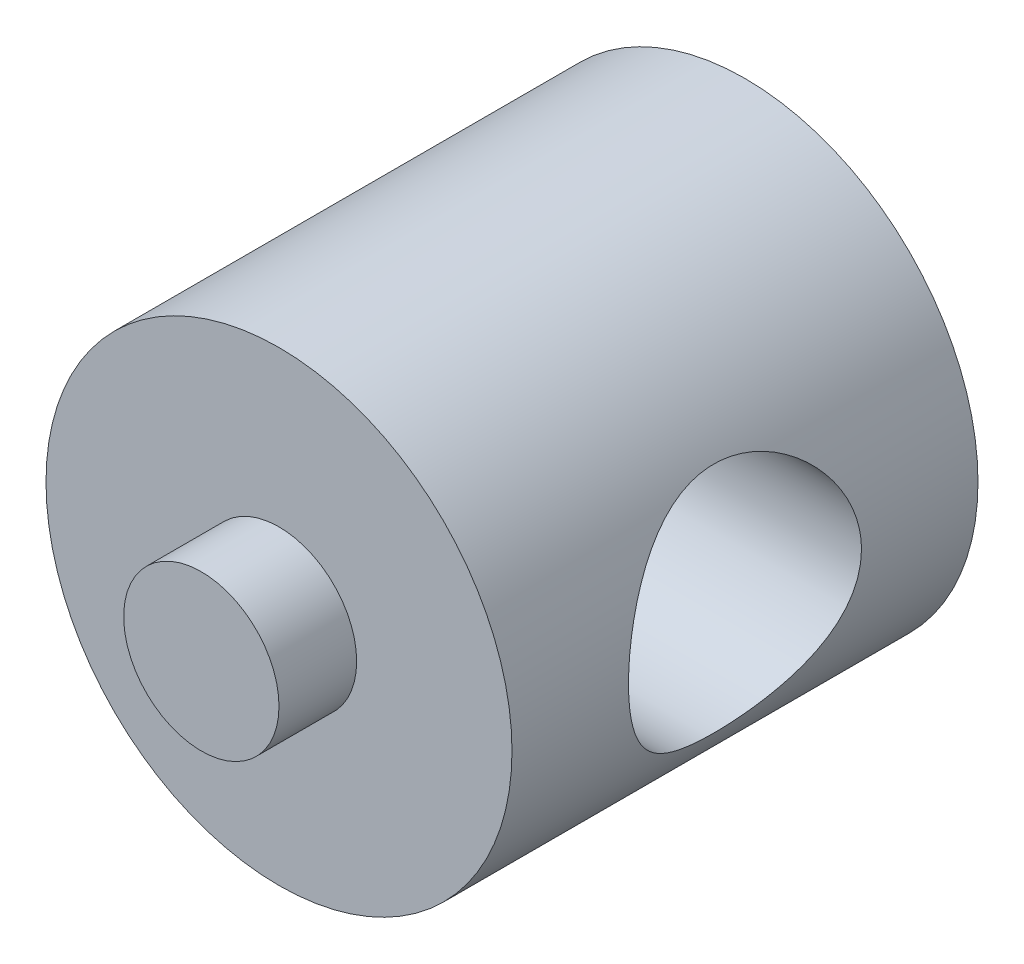
ISO-10303-21;
HEADER;
FILE_DESCRIPTION(('STEP AP214'),'2;1');
FILE_NAME('part.step','',(''),(''),'','','');
FILE_SCHEMA(('AUTOMOTIVE_DESIGN { 1 0 10303 214 1 1 1 1 }'));
ENDSEC;
DATA;
#1=APPLICATION_CONTEXT('core data for automotive mechanical design processes');
#2=APPLICATION_PROTOCOL_DEFINITION('international standard','automotive_design',2000,#1);
#3=PRODUCT_CONTEXT('',#1,'mechanical');
#4=PRODUCT('Part','Part','',(#3));
#5=PRODUCT_RELATED_PRODUCT_CATEGORY('part','',(#4));
#6=PRODUCT_DEFINITION_FORMATION('','',#4);
#7=PRODUCT_DEFINITION_CONTEXT('part definition',#1,'design');
#8=PRODUCT_DEFINITION('design','',#6,#7);
#9=PRODUCT_DEFINITION_SHAPE('','',#8);
#10=(LENGTH_UNIT() NAMED_UNIT(*) SI_UNIT(.MILLI.,.METRE.));
#11=(NAMED_UNIT(*) PLANE_ANGLE_UNIT() SI_UNIT($,.RADIAN.));
#12=(NAMED_UNIT(*) SI_UNIT($,.STERADIAN.) SOLID_ANGLE_UNIT());
#13=UNCERTAINTY_MEASURE_WITH_UNIT(LENGTH_MEASURE(1.E-05),#10,'distance_accuracy_value','');
#14=(GEOMETRIC_REPRESENTATION_CONTEXT(3) GLOBAL_UNCERTAINTY_ASSIGNED_CONTEXT((#13)) GLOBAL_UNIT_ASSIGNED_CONTEXT((#10,
#11,#12)) REPRESENTATION_CONTEXT('',''));
#15=CARTESIAN_POINT('',(0.,0.,0.));
#16=DIRECTION('',(0.,0.,1.));
#17=DIRECTION('',(1.,0.,0.));
#18=AXIS2_PLACEMENT_3D('',#15,#16,#17);
#19=CARTESIAN_POINT('',(0.,0.,9.525));
#20=DIRECTION('',(0.,0.,-1.));
#21=DIRECTION('',(-1.,0.,0.));
#22=AXIS2_PLACEMENT_3D('',#19,#20,#21);
#23=CYLINDRICAL_SURFACE('',#22,9.525);
#24=CARTESIAN_POINT('',(-9.525,0.,-4.7625));
#25=CARTESIAN_POINT('',(-9.5249996206372,0.125243167799989,-4.76249958831423));
#26=CARTESIAN_POINT('',(-9.52252400598023,0.250495089131835,-4.75755388154092));
#27=CARTESIAN_POINT('',(-9.51268396387997,0.500076393496525,-4.73782749335829));
#28=CARTESIAN_POINT('',(-9.50531740964971,0.624405351393145,-4.72304253341983));
#29=CARTESIAN_POINT('',(-9.48587193787975,0.871331001268147,-4.68378465754782));
#30=CARTESIAN_POINT('',(-9.47378630044847,0.993924963523297,-4.65929792572799));
#31=CARTESIAN_POINT('',(-9.44520637539277,1.23637011508467,-4.60090773438337));
#32=CARTESIAN_POINT('',(-9.42871028557932,1.35622016139572,-4.56700042522137));
#33=CARTESIAN_POINT('',(-9.39179697222459,1.59183120722171,-4.49029599546492));
#34=CARTESIAN_POINT('',(-9.37139708461428,1.70760770137533,-4.44753811225714));
#35=CARTESIAN_POINT('',(-9.3271126718355,1.93495086483045,-4.35345002008972));
#36=CARTESIAN_POINT('',(-9.30322683559748,2.04651593025,-4.30211658479887));
#37=CARTESIAN_POINT('',(-9.22716144615755,2.37384489745524,-4.13594585342937));
#38=CARTESIAN_POINT('',(-9.17053150857179,2.58250225923313,-4.00885268845467));
#39=CARTESIAN_POINT('',(-9.04666081910159,2.9885453858336,-3.7170309696508));
#40=CARTESIAN_POINT('',(-8.97898540114139,3.18448556312959,-3.55049071765087));
#41=CARTESIAN_POINT('',(-8.84205954293001,3.5469969745544,-3.18840889326789));
#42=CARTESIAN_POINT('',(-8.77280794740667,3.71354582861883,-2.99284542792684));
#43=CARTESIAN_POINT('',(-8.63435408613187,4.02553537328567,-2.5598674226152));
#44=CARTESIAN_POINT('',(-8.56557212539103,4.16833749963762,-2.32038345074362));
#45=CARTESIAN_POINT('',(-8.47379640254792,4.35029005345507,-1.94317806162735));
#46=CARTESIAN_POINT('',(-8.44509626519091,4.40557901885787,-1.81439982504697));
#47=CARTESIAN_POINT('',(-8.39256904955604,4.50483773649694,-1.55162131087768));
#48=CARTESIAN_POINT('',(-8.36873908777994,4.54881419057647,-1.4176241795386));
#49=CARTESIAN_POINT('',(-8.32818911059645,4.62261399582858,-1.15348439070287));
#50=CARTESIAN_POINT('',(-8.31113119648639,4.65312214328153,-1.0235845780924));
#51=CARTESIAN_POINT('',(-8.28290506375683,4.7031837839128,-0.76111831285817));
#52=CARTESIAN_POINT('',(-8.27173372047612,4.72274308921002,-0.62855331382261));
#53=CARTESIAN_POINT('',(-8.25575723957705,4.75061653464239,-0.36194274554475));
#54=CARTESIAN_POINT('',(-8.25094826797976,4.75893744712047,-0.227898117086417));
#55=CARTESIAN_POINT('',(-8.24790017307781,4.76421854927812,0.0404818193190367));
#56=CARTESIAN_POINT('',(-8.24966042295241,4.76117982286953,0.174817098310511));
#57=CARTESIAN_POINT('',(-8.25906842780931,4.74483797280581,0.426439463053397));
#58=CARTESIAN_POINT('',(-8.26598467895691,4.73280973448218,0.543838732731229));
#59=CARTESIAN_POINT('',(-8.28459407928507,4.7001560114978,0.777063325744908));
#60=CARTESIAN_POINT('',(-8.29628872876442,4.67952782662532,0.89288814292927));
#61=CARTESIAN_POINT('',(-8.33800444414718,4.60506661909892,1.23679640510272));
#62=CARTESIAN_POINT('',(-8.37466460391199,4.5386452957775,1.46148677858525));
#63=CARTESIAN_POINT('',(-8.46236620531704,4.37297035741612,1.90136422745735));
#64=CARTESIAN_POINT('',(-8.51372273880604,4.27298801966147,2.11620803502557));
#65=CARTESIAN_POINT('',(-8.62505005190895,4.04355977442936,2.52713750391294));
#66=CARTESIAN_POINT('',(-8.68502469635285,3.91410063264098,2.72321468317278));
#67=CARTESIAN_POINT('',(-8.8160120789406,3.61029947812718,3.11715493103464));
#68=CARTESIAN_POINT('',(-8.88746017331488,3.43234782914613,3.31209202014425));
#69=CARTESIAN_POINT('',(-9.02721381532401,3.04584295330871,3.67064878147008));
#70=CARTESIAN_POINT('',(-9.0955178493011,2.83727518509305,3.83425348656057));
#71=CARTESIAN_POINT('',(-9.19195370403877,2.49965137796343,4.05616532663717));
#72=CARTESIAN_POINT('',(-9.22372787983903,2.38002127368373,4.12751797031745));
#73=CARTESIAN_POINT('',(-9.28366556941997,2.13427687141611,4.25977821368204));
#74=CARTESIAN_POINT('',(-9.31183060399966,2.00816533613017,4.32069021646027));
#75=CARTESIAN_POINT('',(-9.36371844925579,1.75034069526616,4.43140995548221));
#76=CARTESIAN_POINT('',(-9.38744304755807,1.61862987016266,4.48122216181515));
#77=CARTESIAN_POINT('',(-9.42974072645533,1.35056106639509,4.56916623782169));
#78=CARTESIAN_POINT('',(-9.4483143996453,1.21420362433566,4.60729945117316));
#79=CARTESIAN_POINT('',(-9.47841891468132,0.949450109300047,4.66871072091767));
#80=CARTESIAN_POINT('',(-9.49040564136936,0.821329961906901,4.69295751387122));
#81=CARTESIAN_POINT('',(-9.50921741531494,0.563164063018347,4.73088465881512));
#82=CARTESIAN_POINT('',(-9.51604291885924,0.433118482780759,4.74456594486943));
#83=CARTESIAN_POINT('',(-9.52433687415141,0.172222200636558,4.76117903695803));
#84=CARTESIAN_POINT('',(-9.52580737679104,0.0413718261918288,4.76411495832146));
#85=CARTESIAN_POINT('',(-9.52335444060485,-0.220072847166308,4.75920856581017));
#86=CARTESIAN_POINT('',(-9.51943124049279,-0.350667157156418,4.75136672893597));
#87=CARTESIAN_POINT('',(-9.50681651861088,-0.600383632816324,4.72603956317407));
#88=CARTESIAN_POINT('',(-9.49851975936574,-0.71960779805965,4.70935204534436));
#89=CARTESIAN_POINT('',(-9.47763434053446,-0.956123558476324,4.66708381392194));
#90=CARTESIAN_POINT('',(-9.46504432155854,-1.07341452918894,4.64150028350313));
#91=CARTESIAN_POINT('',(-9.43586934009923,-1.30523272581462,4.58171294409776));
#92=CARTESIAN_POINT('',(-9.41928560017321,-1.41976078572846,4.54751177299423));
#93=CARTESIAN_POINT('',(-9.382499981618,-1.64542419391326,4.47081767633952));
#94=CARTESIAN_POINT('',(-9.36229671724176,-1.75655822362735,4.42832157448654));
#95=CARTESIAN_POINT('',(-9.29566539786795,-2.09007412634844,4.2862997139752));
#96=CARTESIAN_POINT('',(-9.24405921515466,-2.3061103310862,4.17391144344975));
#97=CARTESIAN_POINT('',(-9.13180205397676,-2.7168591855057,3.91901153595821));
#98=CARTESIAN_POINT('',(-9.07114722574502,-2.91156269769227,3.77648706665232));
#99=CARTESIAN_POINT('',(-8.93960783885979,-3.29452731372962,3.44920510528762));
#100=CARTESIAN_POINT('',(-8.868303631423,-3.48027815582499,3.26167471385581));
#101=CARTESIAN_POINT('',(-8.72786114875584,-3.81886460963264,2.85781381337991));
#102=CARTESIAN_POINT('',(-8.65872439991558,-3.97167745144758,2.64146354739159));
#103=CARTESIAN_POINT('',(-8.56092960704944,-4.17638881115549,2.29315273566664));
#104=CARTESIAN_POINT('',(-8.52864647367417,-4.24173741059432,2.16993704199734));
#105=CARTESIAN_POINT('',(-8.46793790675362,-4.36167001930206,1.91748336900804));
#106=CARTESIAN_POINT('',(-8.43951072775552,-4.41625890421415,1.78824815034194));
#107=CARTESIAN_POINT('',(-8.38762286815761,-4.51403084118841,1.52468862385271));
#108=CARTESIAN_POINT('',(-8.36415813189979,-4.55722321448887,1.39036857839809));
#109=CARTESIAN_POINT('',(-8.32316235190995,-4.63167416627274,1.11757678170936));
#110=CARTESIAN_POINT('',(-8.30563038948562,-4.66293459251874,0.979105676886768));
#111=CARTESIAN_POINT('',(-8.27866590076996,-4.71062527640278,0.71269385508765));
#112=CARTESIAN_POINT('',(-8.26861751501085,-4.72819092555356,0.585017991328247));
#113=CARTESIAN_POINT('',(-8.25443000373948,-4.75291664228841,0.328340803473246));
#114=CARTESIAN_POINT('',(-8.25029025909993,-4.76007780009145,0.199339619676062));
#115=CARTESIAN_POINT('',(-8.24809207938036,-4.7638856717754,-0.0588234710669067));
#116=CARTESIAN_POINT('',(-8.25003150672727,-4.76053608147038,-0.187985305559261));
#117=CARTESIAN_POINT('',(-8.2599055190099,-4.74338307929259,-0.445375243945349));
#118=CARTESIAN_POINT('',(-8.26783985851659,-4.72958009537705,-0.573603385847067));
#119=CARTESIAN_POINT('',(-8.28834856879423,-4.69353669139923,-0.815873592556456));
#120=CARTESIAN_POINT('',(-8.30040666790683,-4.67222934629288,-0.930099638041787));
#121=CARTESIAN_POINT('',(-8.32877048505192,-4.62147643847892,-1.15620278401551));
#122=CARTESIAN_POINT('',(-8.34507751652014,-4.59202835912458,-1.26807914659067));
#123=CARTESIAN_POINT('',(-8.3996615585496,-4.49189766535446,-1.59916855214504));
#124=CARTESIAN_POINT('',(-8.44361545117001,-4.40940547807408,-1.81399443047416));
#125=CARTESIAN_POINT('',(-8.54528603634261,-4.20916574352957,-2.24138522605267));
#126=CARTESIAN_POINT('',(-8.60372898549138,-4.08942191082135,-2.45282854237986));
#127=CARTESIAN_POINT('',(-8.72658246261697,-3.82024338512734,-2.85403681438992));
#128=CARTESIAN_POINT('',(-8.79099608593484,-3.67079324521365,-3.04379041048057));
#129=CARTESIAN_POINT('',(-8.92789150982252,-3.32520368388597,-3.42014923519336));
#130=CARTESIAN_POINT('',(-9.00040265167881,-3.12559766366325,-3.60357040787616));
#131=CARTESIAN_POINT('',(-9.13818513010387,-2.69626914168462,-3.93509603617707));
#132=CARTESIAN_POINT('',(-9.20345255422175,-2.4665305095516,-4.08318145555075));
#133=CARTESIAN_POINT('',(-9.29086610240478,-2.10268072495818,-4.2754204698368));
#134=CARTESIAN_POINT('',(-9.3183476000623,-1.97763300723182,-4.33470089313457));
#135=CARTESIAN_POINT('',(-9.36893044835914,-1.72211552262133,-4.44239918870466));
#136=CARTESIAN_POINT('',(-9.39203394996841,-1.59164845695406,-4.49082239743041));
#137=CARTESIAN_POINT('',(-9.43312646132604,-1.32654199767925,-4.57613903004475));
#138=CARTESIAN_POINT('',(-9.45112661821364,-1.19191242135595,-4.6130576010708));
#139=CARTESIAN_POINT('',(-9.48151473751691,-0.919388438520266,-4.67500106044581));
#140=CARTESIAN_POINT('',(-9.49390612793916,-0.781496080561074,-4.700033214082));
#141=CARTESIAN_POINT('',(-9.51048759454479,-0.536297175823771,-4.73342449172891));
#142=CARTESIAN_POINT('',(-9.51592021375587,-0.429411583767847,-4.74431844539165));
#143=CARTESIAN_POINT('',(-9.52317662911679,-0.215019489362876,-4.75885647628327));
#144=CARTESIAN_POINT('',(-9.52500032565785,-0.107512969957933,-4.76250035340499));
#145=CARTESIAN_POINT('',(-9.525,0.,-4.7625));
#146=B_SPLINE_CURVE_WITH_KNOTS('',3,(#24,#25,#26,#27,#28,#29,#30,#31,#32,#33,#34,#35,#36,#37,
#38,#39,#40,#41,#42,#43,#44,#45,#46,#47,#48,#49,#50,#51,#52,#53,#54,#55,#56,#57,#58,#59,#60,#61,
#62,#63,#64,#65,#66,#67,#68,#69,#70,#71,#72,#73,#74,#75,#76,#77,#78,#79,#80,#81,#82,#83,#84,#85,
#86,#87,#88,#89,#90,#91,#92,#93,#94,#95,#96,#97,#98,#99,#100,#101,#102,#103,#104,#105,#106,#107,
#108,#109,#110,#111,#112,#113,#114,#115,#116,#117,#118,#119,#120,#121,#122,#123,#124,#125,#126,
#127,#128,#129,#130,#131,#132,#133,#134,#135,#136,#137,#138,#139,#140,#141,#142,#143,#144,#145),
.UNSPECIFIED.,.T.,.F.,(4,2,2,2,2,2,2,2,2,2,2,2,2,2,2,2,2,2,2,2,2,2,2,2,2,2,2,2,2,2,2,2,2,2,2,2,
2,2,2,2,2,2,2,2,2,2,2,2,2,2,2,2,2,2,2,2,2,2,2,2,4),(0.,0.37562341815402,0.751410280296021,
1.12773421934005,1.50421216665562,1.87905550525341,2.25404018794787,3.00318908218551,
3.79765979831069,4.59273287924314,5.44946389368039,5.8781190538996,6.30651967909288,
6.70950847539314,7.11228314445236,7.51481498990845,7.91730842763879,8.27152461989833,
8.62585211283934,9.33399259637595,10.0586277474397,10.7835888844336,11.6004728904415,
12.4177461446779,12.8458801890468,13.2738332313566,13.701613616489,14.1293447666274,
14.521651524315,14.913923595397,15.3060454158579,15.698149882404,16.0597456619957,
16.4214560413944,16.7830558344937,17.144794364286,17.8882174899416,18.6319578135026,
19.4487341785404,20.2660733794108,20.6950689367829,21.1238696504806,21.5523185520335,
21.9807010777177,22.3679690015927,22.7551963432537,23.1422875423821,23.5293628950278,
23.8794231642634,24.2295917732494,24.9294696536929,25.6763690993088,26.4236579446131,
27.2617475314397,28.1002876036314,28.5230685284025,28.9456411934233,29.3672836019069,
29.7886679587935,30.1111069020891,30.4335547448008),.UNSPECIFIED.);
#147=CARTESIAN_POINT('',(-9.525,0.,-4.7625));
#148=VERTEX_POINT('',#147);
#149=EDGE_CURVE('E10',#148,#148,#146,.T.);
#150=ORIENTED_EDGE('',*,*,#149,.T.);
#151=EDGE_LOOP('',(#150));
#152=FACE_BOUND('',#151,.T.);
#153=CARTESIAN_POINT('',(9.52499999999999,0.,-4.7625));
#154=CARTESIAN_POINT('',(9.5249996206372,-0.125243167799989,-4.76249958831423));
#155=CARTESIAN_POINT('',(9.52252400598023,-0.250495089131836,-4.75755388154092));
#156=CARTESIAN_POINT('',(9.51268396387997,-0.500076393496527,-4.73782749335829));
#157=CARTESIAN_POINT('',(9.50531740964972,-0.624405351393147,-4.72304253341983));
#158=CARTESIAN_POINT('',(9.48587193787975,-0.871331001268149,-4.68378465754782));
#159=CARTESIAN_POINT('',(9.47378630044847,-0.993924963523299,-4.65929792572799));
#160=CARTESIAN_POINT('',(9.44520637539277,-1.23637011508467,-4.60090773438337));
#161=CARTESIAN_POINT('',(9.42871028557932,-1.35622016139572,-4.56700042522137));
#162=CARTESIAN_POINT('',(9.39179697222459,-1.59183120722171,-4.49029599546492));
#163=CARTESIAN_POINT('',(9.37139708461428,-1.70760770137533,-4.44753811225714));
#164=CARTESIAN_POINT('',(9.3271126718355,-1.93495086483046,-4.35345002008972));
#165=CARTESIAN_POINT('',(9.30322683559748,-2.04651593025,-4.30211658479887));
#166=CARTESIAN_POINT('',(9.22716144615755,-2.37384489745524,-4.13594585342936));
#167=CARTESIAN_POINT('',(9.17053150857179,-2.58250225923314,-4.00885268845467));
#168=CARTESIAN_POINT('',(9.04666081910159,-2.98854538583361,-3.7170309696508));
#169=CARTESIAN_POINT('',(8.97898540114139,-3.18448556312959,-3.55049071765087));
#170=CARTESIAN_POINT('',(8.84205954293001,-3.5469969745544,-3.18840889326789));
#171=CARTESIAN_POINT('',(8.77280794740667,-3.71354582861884,-2.99284542792683));
#172=CARTESIAN_POINT('',(8.63435408613186,-4.02553537328567,-2.5598674226152));
#173=CARTESIAN_POINT('',(8.56557212539103,-4.16833749963762,-2.32038345074362));
#174=CARTESIAN_POINT('',(8.47379640254792,-4.35029005345508,-1.94317806162735));
#175=CARTESIAN_POINT('',(8.44509626519091,-4.40557901885787,-1.81439982504697));
#176=CARTESIAN_POINT('',(8.39256904955604,-4.50483773649694,-1.55162131087767));
#177=CARTESIAN_POINT('',(8.36873908777994,-4.54881419057647,-1.41762417953859));
#178=CARTESIAN_POINT('',(8.32818911059645,-4.62261399582858,-1.15348439070287));
#179=CARTESIAN_POINT('',(8.31113119648639,-4.65312214328153,-1.0235845780924));
#180=CARTESIAN_POINT('',(8.28290506375683,-4.70318378391281,-0.761118312858166));
#181=CARTESIAN_POINT('',(8.27173372047612,-4.72274308921002,-0.628553313822606));
#182=CARTESIAN_POINT('',(8.25575723957705,-4.75061653464239,-0.361942745544747));
#183=CARTESIAN_POINT('',(8.25094826797976,-4.75893744712047,-0.227898117086414));
#184=CARTESIAN_POINT('',(8.24790017307781,-4.76421854927812,0.0404818193190395));
#185=CARTESIAN_POINT('',(8.24966042295241,-4.76117982286953,0.174817098310513));
#186=CARTESIAN_POINT('',(8.25906842780931,-4.74483797280581,0.4264394630534));
#187=CARTESIAN_POINT('',(8.26598467895691,-4.73280973448218,0.543838732731232));
#188=CARTESIAN_POINT('',(8.28459407928507,-4.7001560114978,0.77706332574491));
#189=CARTESIAN_POINT('',(8.29628872876443,-4.67952782662532,0.892888142929271));
#190=CARTESIAN_POINT('',(8.33800444414718,-4.60506661909892,1.23679640510272));
#191=CARTESIAN_POINT('',(8.374664603912,-4.5386452957775,1.46148677858525));
#192=CARTESIAN_POINT('',(8.46236620531704,-4.37297035741612,1.90136422745735));
#193=CARTESIAN_POINT('',(8.51372273880604,-4.27298801966147,2.11620803502557));
#194=CARTESIAN_POINT('',(8.62505005190895,-4.04355977442936,2.52713750391294));
#195=CARTESIAN_POINT('',(8.68502469635285,-3.91410063264098,2.72321468317278));
#196=CARTESIAN_POINT('',(8.8160120789406,-3.61029947812718,3.11715493103464));
#197=CARTESIAN_POINT('',(8.88746017331488,-3.43234782914613,3.31209202014425));
#198=CARTESIAN_POINT('',(9.02721381532401,-3.04584295330871,3.67064878147008));
#199=CARTESIAN_POINT('',(9.0955178493011,-2.83727518509305,3.83425348656057));
#200=CARTESIAN_POINT('',(9.19195370403877,-2.49965137796343,4.05616532663717));
#201=CARTESIAN_POINT('',(9.22372787983903,-2.38002127368373,4.12751797031745));
#202=CARTESIAN_POINT('',(9.28366556941997,-2.13427687141611,4.25977821368204));
#203=CARTESIAN_POINT('',(9.31183060399966,-2.00816533613017,4.32069021646027));
#204=CARTESIAN_POINT('',(9.36371844925579,-1.75034069526615,4.43140995548221));
#205=CARTESIAN_POINT('',(9.38744304755807,-1.61862987016266,4.48122216181516));
#206=CARTESIAN_POINT('',(9.42974072645533,-1.35056106639509,4.56916623782169));
#207=CARTESIAN_POINT('',(9.4483143996453,-1.21420362433566,4.60729945117316));
#208=CARTESIAN_POINT('',(9.47841891468132,-0.949450109300047,4.66871072091767));
#209=CARTESIAN_POINT('',(9.49040564136936,-0.8213299619069,4.69295751387122));
#210=CARTESIAN_POINT('',(9.50921741531494,-0.563164063018346,4.73088465881512));
#211=CARTESIAN_POINT('',(9.51604291885924,-0.433118482780757,4.74456594486943));
#212=CARTESIAN_POINT('',(9.52433687415141,-0.172222200636556,4.76117903695803));
#213=CARTESIAN_POINT('',(9.52580737679104,-0.0413718261918264,4.76411495832146));
#214=CARTESIAN_POINT('',(9.52335444060485,0.22007284716631,4.75920856581017));
#215=CARTESIAN_POINT('',(9.51943124049279,0.35066715715642,4.75136672893597));
#216=CARTESIAN_POINT('',(9.50681651861088,0.600383632816326,4.72603956317407));
#217=CARTESIAN_POINT('',(9.49851975936574,0.719607798059654,4.70935204534436));
#218=CARTESIAN_POINT('',(9.47763434053446,0.956123558476328,4.66708381392194));
#219=CARTESIAN_POINT('',(9.46504432155854,1.07341452918895,4.64150028350313));
#220=CARTESIAN_POINT('',(9.43586934009923,1.30523272581463,4.58171294409775));
#221=CARTESIAN_POINT('',(9.41928560017321,1.41976078572846,4.54751177299423));
#222=CARTESIAN_POINT('',(9.382499981618,1.64542419391326,4.47081767633952));
#223=CARTESIAN_POINT('',(9.36229671724176,1.75655822362735,4.42832157448654));
#224=CARTESIAN_POINT('',(9.29566539786795,2.09007412634845,4.2862997139752));
#225=CARTESIAN_POINT('',(9.24405921515466,2.3061103310862,4.17391144344975));
#226=CARTESIAN_POINT('',(9.13180205397676,2.71685918550571,3.91901153595821));
#227=CARTESIAN_POINT('',(9.07114722574502,2.91156269769227,3.77648706665231));
#228=CARTESIAN_POINT('',(8.93960783885979,3.29452731372962,3.44920510528762));
#229=CARTESIAN_POINT('',(8.868303631423,3.48027815582499,3.26167471385581));
#230=CARTESIAN_POINT('',(8.72786114875584,3.81886460963264,2.85781381337991));
#231=CARTESIAN_POINT('',(8.65872439991558,3.97167745144758,2.64146354739159));
#232=CARTESIAN_POINT('',(8.56092960704944,4.17638881115549,2.29315273566663));
#233=CARTESIAN_POINT('',(8.52864647367417,4.24173741059432,2.16993704199734));
#234=CARTESIAN_POINT('',(8.46793790675362,4.36167001930206,1.91748336900803));
#235=CARTESIAN_POINT('',(8.43951072775552,4.41625890421415,1.78824815034193));
#236=CARTESIAN_POINT('',(8.3876228681576,4.51403084118841,1.52468862385271));
#237=CARTESIAN_POINT('',(8.36415813189979,4.55722321448887,1.39036857839808));
#238=CARTESIAN_POINT('',(8.32316235190995,4.63167416627274,1.11757678170936));
#239=CARTESIAN_POINT('',(8.30563038948562,4.66293459251874,0.979105676886764));
#240=CARTESIAN_POINT('',(8.27866590076996,4.71062527640278,0.712693855087645));
#241=CARTESIAN_POINT('',(8.26861751501085,4.72819092555356,0.585017991328243));
#242=CARTESIAN_POINT('',(8.25443000373948,4.75291664228841,0.328340803473241));
#243=CARTESIAN_POINT('',(8.25029025909993,4.76007780009145,0.199339619676057));
#244=CARTESIAN_POINT('',(8.24809207938036,4.7638856717754,-0.0588234710669095));
#245=CARTESIAN_POINT('',(8.25003150672727,4.76053608147038,-0.187985305559263));
#246=CARTESIAN_POINT('',(8.2599055190099,4.74338307929259,-0.44537524394535));
#247=CARTESIAN_POINT('',(8.26783985851659,4.72958009537705,-0.573603385847069));
#248=CARTESIAN_POINT('',(8.28834856879423,4.69353669139923,-0.815873592556459));
#249=CARTESIAN_POINT('',(8.30040666790683,4.67222934629288,-0.93009963804179));
#250=CARTESIAN_POINT('',(8.32877048505192,4.62147643847892,-1.15620278401552));
#251=CARTESIAN_POINT('',(8.34507751652014,4.59202835912458,-1.26807914659067));
#252=CARTESIAN_POINT('',(8.3996615585496,4.49189766535446,-1.59916855214504));
#253=CARTESIAN_POINT('',(8.44361545117001,4.40940547807408,-1.81399443047417));
#254=CARTESIAN_POINT('',(8.54528603634261,4.20916574352957,-2.24138522605267));
#255=CARTESIAN_POINT('',(8.60372898549138,4.08942191082135,-2.45282854237986));
#256=CARTESIAN_POINT('',(8.72658246261697,3.82024338512734,-2.85403681438992));
#257=CARTESIAN_POINT('',(8.79099608593484,3.67079324521365,-3.04379041048057));
#258=CARTESIAN_POINT('',(8.92789150982252,3.32520368388597,-3.42014923519336));
#259=CARTESIAN_POINT('',(9.00040265167881,3.12559766366325,-3.60357040787616));
#260=CARTESIAN_POINT('',(9.13818513010387,2.69626914168462,-3.93509603617707));
#261=CARTESIAN_POINT('',(9.20345255422175,2.4665305095516,-4.08318145555075));
#262=CARTESIAN_POINT('',(9.29086610240478,2.10268072495818,-4.2754204698368));
#263=CARTESIAN_POINT('',(9.31834760006229,1.97763300723182,-4.33470089313457));
#264=CARTESIAN_POINT('',(9.36893044835914,1.72211552262134,-4.44239918870466));
#265=CARTESIAN_POINT('',(9.39203394996841,1.59164845695407,-4.49082239743041));
#266=CARTESIAN_POINT('',(9.43312646132604,1.32654199767925,-4.57613903004475));
#267=CARTESIAN_POINT('',(9.45112661821365,1.19191242135595,-4.6130576010708));
#268=CARTESIAN_POINT('',(9.48151473751691,0.919388438520268,-4.67500106044581));
#269=CARTESIAN_POINT('',(9.49390612793916,0.781496080561074,-4.700033214082));
#270=CARTESIAN_POINT('',(9.51048759454479,0.53629717582377,-4.73342449172891));
#271=CARTESIAN_POINT('',(9.51592021375587,0.429411583767847,-4.74431844539165));
#272=CARTESIAN_POINT('',(9.52317662911679,0.215019489362877,-4.75885647628327));
#273=CARTESIAN_POINT('',(9.52500032565784,0.107512969957933,-4.76250035340498));
#274=CARTESIAN_POINT('',(9.52499999999999,0.,-4.7625));
#275=B_SPLINE_CURVE_WITH_KNOTS('',3,(#153,#154,#155,#156,#157,#158,#159,#160,#161,#162,#163,
#164,#165,#166,#167,#168,#169,#170,#171,#172,#173,#174,#175,#176,#177,#178,#179,#180,#181,#182,
#183,#184,#185,#186,#187,#188,#189,#190,#191,#192,#193,#194,#195,#196,#197,#198,#199,#200,#201,
#202,#203,#204,#205,#206,#207,#208,#209,#210,#211,#212,#213,#214,#215,#216,#217,#218,#219,#220,
#221,#222,#223,#224,#225,#226,#227,#228,#229,#230,#231,#232,#233,#234,#235,#236,#237,#238,#239,
#240,#241,#242,#243,#244,#245,#246,#247,#248,#249,#250,#251,#252,#253,#254,#255,#256,#257,#258,
#259,#260,#261,#262,#263,#264,#265,#266,#267,#268,#269,#270,#271,#272,#273,#274),.UNSPECIFIED.,
.T.,.F.,(4,2,2,2,2,2,2,2,2,2,2,2,2,2,2,2,2,2,2,2,2,2,2,2,2,2,2,2,2,2,2,2,2,2,2,2,2,2,2,2,2,2,2,
2,2,2,2,2,2,2,2,2,2,2,2,2,2,2,2,2,4),(0.,0.375623418154021,0.751410280296022,1.12773421934006,
1.50421216665563,1.87905550525341,2.25404018794787,3.00318908218551,3.7976597983107,
4.59273287924314,5.4494638936804,5.8781190538996,6.30651967909289,6.70950847539315,
7.11228314445237,7.51481498990845,7.91730842763879,8.27152461989833,8.62585211283934,
9.33399259637595,10.0586277474397,10.7835888844336,11.6004728904415,12.4177461446779,
12.8458801890468,13.2738332313566,13.701613616489,14.1293447666274,14.521651524315,
14.913923595397,15.3060454158579,15.698149882404,16.0597456619957,16.4214560413944,
16.7830558344937,17.144794364286,17.8882174899416,18.6319578135026,19.4487341785404,
20.2660733794108,20.6950689367829,21.1238696504806,21.5523185520335,21.9807010777177,
22.3679690015927,22.7551963432537,23.1422875423821,23.5293628950278,23.8794231642634,
24.2295917732494,24.9294696536929,25.6763690993088,26.423657944613,27.2617475314397,
28.1002876036314,28.5230685284024,28.9456411934233,29.3672836019069,29.7886679587935,
30.1111069020891,30.4335547448008),.UNSPECIFIED.);
#276=CARTESIAN_POINT('',(9.52499999999999,0.,-4.7625));
#277=VERTEX_POINT('',#276);
#278=EDGE_CURVE('E49',#277,#277,#275,.T.);
#279=ORIENTED_EDGE('',*,*,#278,.T.);
#280=EDGE_LOOP('',(#279));
#281=FACE_BOUND('',#280,.T.);
#282=CARTESIAN_POINT('',(0.,0.,9.525));
#283=DIRECTION('',(0.,0.,1.));
#284=DIRECTION('',(1.,0.,0.));
#285=AXIS2_PLACEMENT_3D('',#282,#283,#284);
#286=CIRCLE('',#285,9.525);
#287=CARTESIAN_POINT('',(9.525,0.,9.525));
#288=VERTEX_POINT('',#287);
#289=EDGE_CURVE('E59',#288,#288,#286,.T.);
#290=ORIENTED_EDGE('',*,*,#289,.F.);
#291=EDGE_LOOP('',(#290));
#292=FACE_BOUND('',#291,.T.);
#293=CARTESIAN_POINT('',(0.,0.,-9.525));
#294=DIRECTION('',(0.,0.,1.));
#295=DIRECTION('',(1.,0.,0.));
#296=AXIS2_PLACEMENT_3D('',#293,#294,#295);
#297=CIRCLE('',#296,9.525);
#298=CARTESIAN_POINT('',(9.525,0.,-9.525));
#299=VERTEX_POINT('',#298);
#300=EDGE_CURVE('E103',#299,#299,#297,.T.);
#301=ORIENTED_EDGE('',*,*,#300,.T.);
#302=EDGE_LOOP('',(#301));
#303=FACE_BOUND('',#302,.T.);
#304=ADVANCED_FACE('F37',(#152,#281,#292,#303),#23,.T.);
#305=CARTESIAN_POINT('',(0.,0.,9.525));
#306=DIRECTION('',(0.,0.,1.));
#307=DIRECTION('',(1.,0.,0.));
#308=AXIS2_PLACEMENT_3D('',#305,#306,#307);
#309=PLANE('',#308);
#310=CARTESIAN_POINT('',(0.,0.,9.525));
#311=DIRECTION('',(0.,0.,1.));
#312=DIRECTION('',(1.,0.,0.));
#313=AXIS2_PLACEMENT_3D('',#310,#311,#312);
#314=CIRCLE('',#313,3.175);
#315=CARTESIAN_POINT('',(3.175,0.,9.525));
#316=VERTEX_POINT('',#315);
#317=EDGE_CURVE('E105',#316,#316,#314,.F.);
#318=ORIENTED_EDGE('',*,*,#317,.T.);
#319=EDGE_LOOP('',(#318));
#320=FACE_BOUND('',#319,.T.);
#321=ORIENTED_EDGE('',*,*,#289,.T.);
#322=EDGE_LOOP('',(#321));
#323=FACE_BOUND('',#322,.T.);
#324=ADVANCED_FACE('F85',(#320,#323),#309,.T.);
#325=CARTESIAN_POINT('',(0.,0.,-9.525));
#326=DIRECTION('',(0.,0.,1.));
#327=DIRECTION('',(1.,0.,0.));
#328=AXIS2_PLACEMENT_3D('',#325,#326,#327);
#329=PLANE('',#328);
#330=CARTESIAN_POINT('',(0.,0.,-9.525));
#331=DIRECTION('',(0.,0.,1.));
#332=DIRECTION('',(1.,0.,0.));
#333=AXIS2_PLACEMENT_3D('',#330,#331,#332);
#334=CIRCLE('',#333,3.175);
#335=CARTESIAN_POINT('',(3.175,0.,-9.525));
#336=VERTEX_POINT('',#335);
#337=EDGE_CURVE('E54',#336,#336,#334,.F.);
#338=ORIENTED_EDGE('',*,*,#337,.F.);
#339=EDGE_LOOP('',(#338));
#340=FACE_BOUND('',#339,.T.);
#341=ORIENTED_EDGE('',*,*,#300,.F.);
#342=EDGE_LOOP('',(#341));
#343=FACE_BOUND('',#342,.T.);
#344=ADVANCED_FACE('F80',(#340,#343),#329,.F.);
#345=CARTESIAN_POINT('',(0.,0.,-12.7));
#346=DIRECTION('',(0.,0.,1.));
#347=DIRECTION('',(1.,0.,0.));
#348=AXIS2_PLACEMENT_3D('',#345,#346,#347);
#349=PLANE('',#348);
#350=CARTESIAN_POINT('',(0.,0.,-12.7));
#351=DIRECTION('',(0.,0.,1.));
#352=DIRECTION('',(1.,0.,0.));
#353=AXIS2_PLACEMENT_3D('',#350,#351,#352);
#354=CIRCLE('',#353,3.175);
#355=CARTESIAN_POINT('',(3.175,0.,-12.7));
#356=VERTEX_POINT('',#355);
#357=EDGE_CURVE('E113',#356,#356,#354,.T.);
#358=ORIENTED_EDGE('',*,*,#357,.F.);
#359=EDGE_LOOP('',(#358));
#360=FACE_BOUND('',#359,.T.);
#361=ADVANCED_FACE('F76',(#360),#349,.F.);
#362=CARTESIAN_POINT('',(0.,0.,12.7));
#363=DIRECTION('',(0.,0.,-1.));
#364=DIRECTION('',(-1.,0.,0.));
#365=AXIS2_PLACEMENT_3D('',#362,#363,#364);
#366=CYLINDRICAL_SURFACE('',#365,3.175);
#367=ORIENTED_EDGE('',*,*,#357,.T.);
#368=EDGE_LOOP('',(#367));
#369=FACE_BOUND('',#368,.T.);
#370=ORIENTED_EDGE('',*,*,#337,.T.);
#371=EDGE_LOOP('',(#370));
#372=FACE_BOUND('',#371,.T.);
#373=ADVANCED_FACE('F79',(#369,#372),#366,.T.);
#374=ORIENTED_EDGE('',*,*,#317,.F.);
#375=EDGE_LOOP('',(#374));
#376=FACE_BOUND('',#375,.T.);
#377=CARTESIAN_POINT('',(0.,0.,12.7));
#378=DIRECTION('',(0.,0.,1.));
#379=DIRECTION('',(1.,0.,0.));
#380=AXIS2_PLACEMENT_3D('',#377,#378,#379);
#381=CIRCLE('',#380,3.175);
#382=CARTESIAN_POINT('',(3.175,0.,12.7));
#383=VERTEX_POINT('',#382);
#384=EDGE_CURVE('E110',#383,#383,#381,.T.);
#385=ORIENTED_EDGE('',*,*,#384,.F.);
#386=EDGE_LOOP('',(#385));
#387=FACE_BOUND('',#386,.T.);
#388=ADVANCED_FACE('F74',(#376,#387),#366,.T.);
#389=CARTESIAN_POINT('',(0.,0.,12.7));
#390=DIRECTION('',(0.,0.,1.));
#391=DIRECTION('',(1.,0.,0.));
#392=AXIS2_PLACEMENT_3D('',#389,#390,#391);
#393=PLANE('',#392);
#394=ORIENTED_EDGE('',*,*,#384,.T.);
#395=EDGE_LOOP('',(#394));
#396=FACE_BOUND('',#395,.T.);
#397=ADVANCED_FACE('F69',(#396),#393,.T.);
#398=CARTESIAN_POINT('',(-9.525,0.,0.));
#399=DIRECTION('',(1.,0.,0.));
#400=DIRECTION('',(0.,0.,-1.));
#401=AXIS2_PLACEMENT_3D('',#398,#399,#400);
#402=CYLINDRICAL_SURFACE('',#401,4.7625);
#403=ORIENTED_EDGE('',*,*,#278,.F.);
#404=EDGE_LOOP('',(#403));
#405=FACE_BOUND('',#404,.T.);
#406=ORIENTED_EDGE('',*,*,#149,.F.);
#407=EDGE_LOOP('',(#406));
#408=FACE_BOUND('',#407,.T.);
#409=ADVANCED_FACE('F65',(#405,#408),#402,.F.);
#410=CLOSED_SHELL('',(#304,#324,#344,#361,#373,#388,#397,#409));
#411=MANIFOLD_SOLID_BREP('B2',#410);
#412=ADVANCED_BREP_SHAPE_REPRESENTATION('',(#18,#411),#14);
#413=SHAPE_DEFINITION_REPRESENTATION(#9,#412);
ENDSEC;
END-ISO-10303-21;
